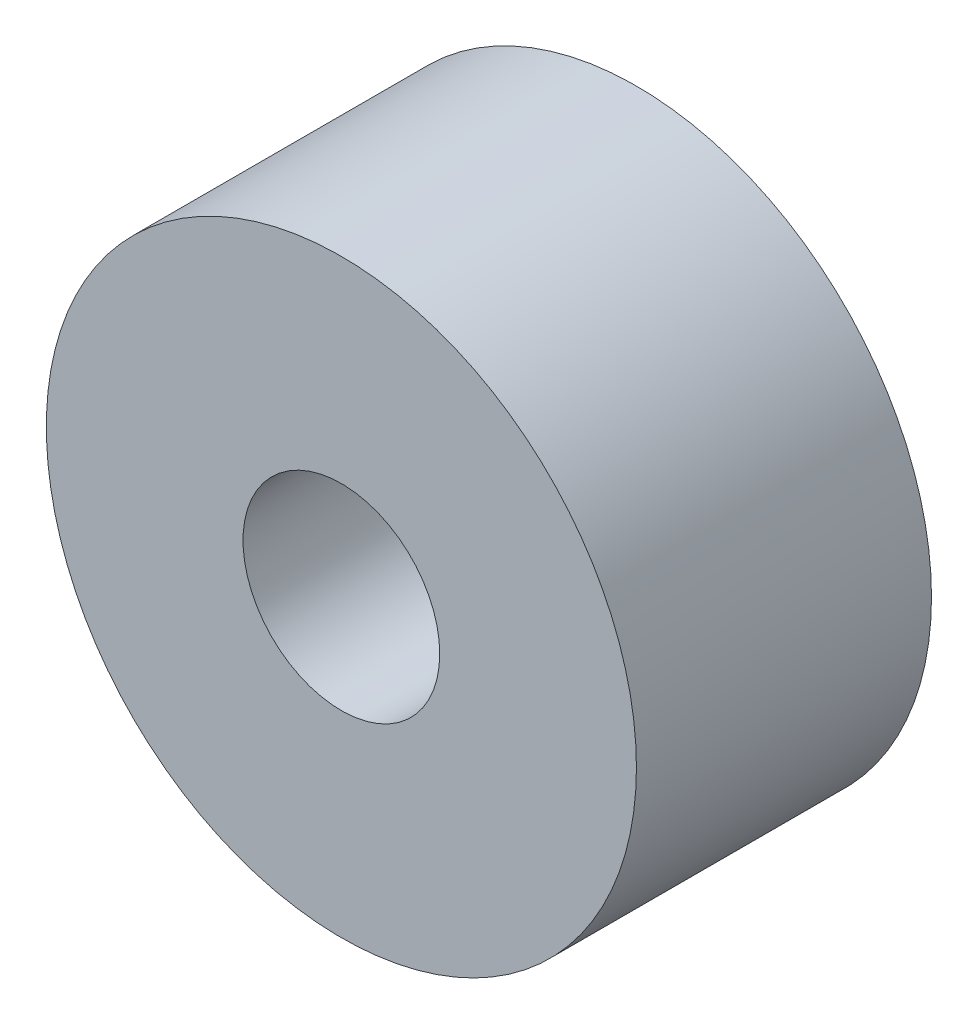
ISO-10303-21;
HEADER;
FILE_DESCRIPTION(('STEP AP214'),'2;1');
FILE_NAME('part.step','',(''),(''),'','','');
FILE_SCHEMA(('AUTOMOTIVE_DESIGN { 1 0 10303 214 1 1 1 1 }'));
ENDSEC;
DATA;
#1=APPLICATION_CONTEXT('core data for automotive mechanical design processes');
#2=APPLICATION_PROTOCOL_DEFINITION('international standard','automotive_design',2000,#1);
#3=PRODUCT_CONTEXT('',#1,'mechanical');
#4=PRODUCT('Part','Part','',(#3));
#5=PRODUCT_RELATED_PRODUCT_CATEGORY('part','',(#4));
#6=PRODUCT_DEFINITION_FORMATION('','',#4);
#7=PRODUCT_DEFINITION_CONTEXT('part definition',#1,'design');
#8=PRODUCT_DEFINITION('design','',#6,#7);
#9=PRODUCT_DEFINITION_SHAPE('','',#8);
#10=(LENGTH_UNIT() NAMED_UNIT(*) SI_UNIT(.MILLI.,.METRE.));
#11=(NAMED_UNIT(*) PLANE_ANGLE_UNIT() SI_UNIT($,.RADIAN.));
#12=(NAMED_UNIT(*) SI_UNIT($,.STERADIAN.) SOLID_ANGLE_UNIT());
#13=UNCERTAINTY_MEASURE_WITH_UNIT(LENGTH_MEASURE(1.E-05),#10,'distance_accuracy_value','');
#14=(GEOMETRIC_REPRESENTATION_CONTEXT(3) GLOBAL_UNCERTAINTY_ASSIGNED_CONTEXT((#13)) GLOBAL_UNIT_ASSIGNED_CONTEXT((#10,
#11,#12)) REPRESENTATION_CONTEXT('',''));
#15=CARTESIAN_POINT('',(0.,0.,0.));
#16=DIRECTION('',(0.,0.,1.));
#17=DIRECTION('',(1.,0.,0.));
#18=AXIS2_PLACEMENT_3D('',#15,#16,#17);
#19=CARTESIAN_POINT('',(0.,3.,1.5));
#20=DIRECTION('',(0.,0.,-1.));
#21=DIRECTION('',(-1.,0.,0.));
#22=AXIS2_PLACEMENT_3D('',#19,#20,#21);
#23=PLANE('',#22);
#24=CARTESIAN_POINT('',(0.,0.,1.5));
#25=DIRECTION('',(0.,0.,1.));
#26=DIRECTION('',(1.,0.,0.));
#27=AXIS2_PLACEMENT_3D('',#24,#25,#26);
#28=CIRCLE('',#27,1.);
#29=CARTESIAN_POINT('',(1.,0.,1.5));
#30=VERTEX_POINT('',#29);
#31=EDGE_CURVE('E10',#30,#30,#28,.T.);
#32=ORIENTED_EDGE('',*,*,#31,.F.);
#33=EDGE_LOOP('',(#32));
#34=FACE_BOUND('',#33,.T.);
#35=CARTESIAN_POINT('',(0.,0.,1.5));
#36=DIRECTION('',(0.,0.,1.));
#37=DIRECTION('',(1.,0.,0.));
#38=AXIS2_PLACEMENT_3D('',#35,#36,#37);
#39=CIRCLE('',#38,3.);
#40=CARTESIAN_POINT('',(3.,0.,1.5));
#41=VERTEX_POINT('',#40);
#42=EDGE_CURVE('E44',#41,#41,#39,.T.);
#43=ORIENTED_EDGE('',*,*,#42,.T.);
#44=EDGE_LOOP('',(#43));
#45=FACE_BOUND('',#44,.T.);
#46=ADVANCED_FACE('F30',(#34,#45),#23,.F.);
#47=CARTESIAN_POINT('',(0.,0.,0.));
#48=DIRECTION('',(0.,0.,1.));
#49=DIRECTION('',(1.,0.,0.));
#50=AXIS2_PLACEMENT_3D('',#47,#48,#49);
#51=CYLINDRICAL_SURFACE('',#50,1.);
#52=CARTESIAN_POINT('',(0.,0.,-1.5));
#53=DIRECTION('',(0.,0.,1.));
#54=DIRECTION('',(1.,0.,0.));
#55=AXIS2_PLACEMENT_3D('',#52,#53,#54);
#56=CIRCLE('',#55,1.);
#57=CARTESIAN_POINT('',(1.,0.,-1.5));
#58=VERTEX_POINT('',#57);
#59=EDGE_CURVE('E36',#58,#58,#56,.T.);
#60=ORIENTED_EDGE('',*,*,#59,.F.);
#61=EDGE_LOOP('',(#60));
#62=FACE_BOUND('',#61,.T.);
#63=ORIENTED_EDGE('',*,*,#31,.T.);
#64=EDGE_LOOP('',(#63));
#65=FACE_BOUND('',#64,.T.);
#66=ADVANCED_FACE('F59',(#62,#65),#51,.F.);
#67=CARTESIAN_POINT('',(0.,3.,-1.5));
#68=DIRECTION('',(0.,0.,1.));
#69=DIRECTION('',(1.,0.,0.));
#70=AXIS2_PLACEMENT_3D('',#67,#68,#69);
#71=PLANE('',#70);
#72=CARTESIAN_POINT('',(0.,0.,-1.5));
#73=DIRECTION('',(0.,0.,1.));
#74=DIRECTION('',(1.,0.,0.));
#75=AXIS2_PLACEMENT_3D('',#72,#73,#74);
#76=CIRCLE('',#75,3.);
#77=CARTESIAN_POINT('',(3.,0.,-1.5));
#78=VERTEX_POINT('',#77);
#79=EDGE_CURVE('E40',#78,#78,#76,.T.);
#80=ORIENTED_EDGE('',*,*,#79,.F.);
#81=EDGE_LOOP('',(#80));
#82=FACE_BOUND('',#81,.T.);
#83=ORIENTED_EDGE('',*,*,#59,.T.);
#84=EDGE_LOOP('',(#83));
#85=FACE_BOUND('',#84,.T.);
#86=ADVANCED_FACE('F54',(#82,#85),#71,.F.);
#87=CARTESIAN_POINT('',(0.,0.,0.));
#88=DIRECTION('',(0.,0.,1.));
#89=DIRECTION('',(1.,0.,0.));
#90=AXIS2_PLACEMENT_3D('',#87,#88,#89);
#91=CYLINDRICAL_SURFACE('',#90,3.);
#92=ORIENTED_EDGE('',*,*,#42,.F.);
#93=EDGE_LOOP('',(#92));
#94=FACE_BOUND('',#93,.T.);
#95=ORIENTED_EDGE('',*,*,#79,.T.);
#96=EDGE_LOOP('',(#95));
#97=FACE_BOUND('',#96,.T.);
#98=ADVANCED_FACE('F51',(#94,#97),#91,.T.);
#99=CLOSED_SHELL('',(#46,#66,#86,#98));
#100=MANIFOLD_SOLID_BREP('B2',#99);
#101=ADVANCED_BREP_SHAPE_REPRESENTATION('',(#18,#100),#14);
#102=SHAPE_DEFINITION_REPRESENTATION(#9,#101);
ENDSEC;
END-ISO-10303-21;
